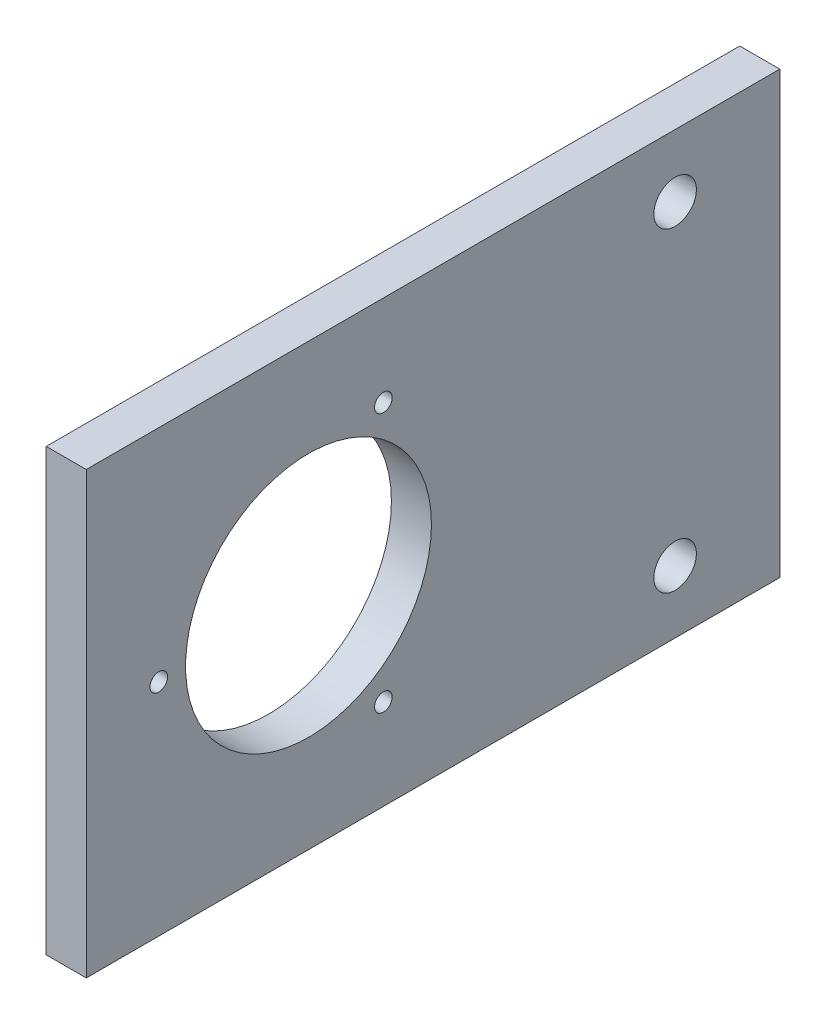
ISO-10303-21;
HEADER;
FILE_DESCRIPTION(('STEP AP214'),'2;1');
FILE_NAME('part.step','',(''),(''),'','','');
FILE_SCHEMA(('AUTOMOTIVE_DESIGN { 1 0 10303 214 1 1 1 1 }'));
ENDSEC;
DATA;
#1=APPLICATION_CONTEXT('core data for automotive mechanical design processes');
#2=APPLICATION_PROTOCOL_DEFINITION('international standard','automotive_design',2000,#1);
#3=PRODUCT_CONTEXT('',#1,'mechanical');
#4=PRODUCT('Part','Part','',(#3));
#5=PRODUCT_RELATED_PRODUCT_CATEGORY('part','',(#4));
#6=PRODUCT_DEFINITION_FORMATION('','',#4);
#7=PRODUCT_DEFINITION_CONTEXT('part definition',#1,'design');
#8=PRODUCT_DEFINITION('design','',#6,#7);
#9=PRODUCT_DEFINITION_SHAPE('','',#8);
#10=(LENGTH_UNIT() NAMED_UNIT(*) SI_UNIT(.MILLI.,.METRE.));
#11=(NAMED_UNIT(*) PLANE_ANGLE_UNIT() SI_UNIT($,.RADIAN.));
#12=(NAMED_UNIT(*) SI_UNIT($,.STERADIAN.) SOLID_ANGLE_UNIT());
#13=UNCERTAINTY_MEASURE_WITH_UNIT(LENGTH_MEASURE(1.E-05),#10,'distance_accuracy_value','');
#14=(GEOMETRIC_REPRESENTATION_CONTEXT(3) GLOBAL_UNCERTAINTY_ASSIGNED_CONTEXT((#13)) GLOBAL_UNIT_ASSIGNED_CONTEXT((#10,
#11,#12)) REPRESENTATION_CONTEXT('',''));
#15=CARTESIAN_POINT('',(0.,0.,0.));
#16=DIRECTION('',(0.,0.,1.));
#17=DIRECTION('',(1.,0.,0.));
#18=AXIS2_PLACEMENT_3D('',#15,#16,#17);
#19=CARTESIAN_POINT('',(6.35,0.,0.));
#20=DIRECTION('',(-1.,0.,0.));
#21=DIRECTION('',(0.,0.,1.));
#22=AXIS2_PLACEMENT_3D('',#19,#20,#21);
#23=PLANE('',#22);
#24=DIRECTION('',(0.,0.,1.));
#25=VECTOR('',#24,1.);
#26=CARTESIAN_POINT('',(6.35,34.925,-55.));
#27=LINE('',#26,#25);
#28=CARTESIAN_POINT('',(6.35,34.925,-55.));
#29=VERTEX_POINT('',#28);
#30=CARTESIAN_POINT('',(6.35,34.925,55.));
#31=VERTEX_POINT('',#30);
#32=EDGE_CURVE('E95',#29,#31,#27,.T.);
#33=ORIENTED_EDGE('',*,*,#32,.T.);
#34=DIRECTION('',(0.,-1.,0.));
#35=VECTOR('',#34,1.);
#36=CARTESIAN_POINT('',(6.35,-34.925,55.));
#37=LINE('',#36,#35);
#38=CARTESIAN_POINT('',(6.35,-34.925,55.));
#39=VERTEX_POINT('',#38);
#40=EDGE_CURVE('E90',#31,#39,#37,.T.);
#41=ORIENTED_EDGE('',*,*,#40,.T.);
#42=DIRECTION('',(0.,0.,-1.));
#43=VECTOR('',#42,1.);
#44=CARTESIAN_POINT('',(6.35,-34.925,-55.));
#45=LINE('',#44,#43);
#46=CARTESIAN_POINT('',(6.35,-34.925,-55.));
#47=VERTEX_POINT('',#46);
#48=EDGE_CURVE('E93',#39,#47,#45,.T.);
#49=ORIENTED_EDGE('',*,*,#48,.T.);
#50=DIRECTION('',(0.,1.,0.));
#51=VECTOR('',#50,1.);
#52=CARTESIAN_POINT('',(6.35,-34.925,-55.));
#53=LINE('',#52,#51);
#54=EDGE_CURVE('E60',#47,#29,#53,.T.);
#55=ORIENTED_EDGE('',*,*,#54,.T.);
#56=EDGE_LOOP('',(#33,#41,#49,#55));
#57=FACE_BOUND('',#56,.T.);
#58=CARTESIAN_POINT('',(6.35,0.,43.5));
#59=DIRECTION('',(1.,0.,0.));
#60=DIRECTION('',(0.,0.,-1.));
#61=AXIS2_PLACEMENT_3D('',#58,#59,#60);
#62=CIRCLE('',#61,1.4);
#63=CARTESIAN_POINT('',(6.35,0.,42.1));
#64=VERTEX_POINT('',#63);
#65=EDGE_CURVE('E110',#64,#64,#62,.T.);
#66=ORIENTED_EDGE('',*,*,#65,.F.);
#67=EDGE_LOOP('',(#66));
#68=FACE_BOUND('',#67,.T.);
#69=CARTESIAN_POINT('',(6.35,-20.5681033398804,7.87499999999994));
#70=DIRECTION('',(1.,0.,0.));
#71=DIRECTION('',(0.,0.,-1.));
#72=AXIS2_PLACEMENT_3D('',#69,#70,#71);
#73=CIRCLE('',#72,1.40000000000002);
#74=CARTESIAN_POINT('',(6.35,-20.5681033398804,6.47499999999992));
#75=VERTEX_POINT('',#74);
#76=EDGE_CURVE('E125',#75,#75,#73,.T.);
#77=ORIENTED_EDGE('',*,*,#76,.F.);
#78=EDGE_LOOP('',(#77));
#79=FACE_BOUND('',#78,.T.);
#80=CARTESIAN_POINT('',(6.35,20.5681033398805,7.87500000000005));
#81=DIRECTION('',(1.,0.,0.));
#82=DIRECTION('',(0.,0.,-1.));
#83=AXIS2_PLACEMENT_3D('',#80,#81,#82);
#84=CIRCLE('',#83,1.39999999999999);
#85=CARTESIAN_POINT('',(6.35,20.5681033398805,6.47500000000006));
#86=VERTEX_POINT('',#85);
#87=EDGE_CURVE('E131',#86,#86,#84,.T.);
#88=ORIENTED_EDGE('',*,*,#87,.F.);
#89=EDGE_LOOP('',(#88));
#90=FACE_BOUND('',#89,.T.);
#91=CARTESIAN_POINT('',(6.35,0.,19.75));
#92=DIRECTION('',(1.,0.,0.));
#93=DIRECTION('',(0.,0.,-1.));
#94=AXIS2_PLACEMENT_3D('',#91,#92,#93);
#95=CIRCLE('',#94,19.5);
#96=CARTESIAN_POINT('',(6.35,0.,0.249999999999997));
#97=VERTEX_POINT('',#96);
#98=EDGE_CURVE('E137',#97,#97,#95,.T.);
#99=ORIENTED_EDGE('',*,*,#98,.F.);
#100=EDGE_LOOP('',(#99));
#101=FACE_BOUND('',#100,.T.);
#102=CARTESIAN_POINT('',(6.35,-25.,-38.4));
#103=DIRECTION('',(1.,0.,0.));
#104=DIRECTION('',(0.,0.,-1.));
#105=AXIS2_PLACEMENT_3D('',#102,#103,#104);
#106=CIRCLE('',#105,3.37312);
#107=CARTESIAN_POINT('',(6.35,-25.,-41.77312));
#108=VERTEX_POINT('',#107);
#109=EDGE_CURVE('E143',#108,#108,#106,.T.);
#110=ORIENTED_EDGE('',*,*,#109,.F.);
#111=EDGE_LOOP('',(#110));
#112=FACE_BOUND('',#111,.T.);
#113=CARTESIAN_POINT('',(6.35,25.,-38.4));
#114=DIRECTION('',(1.,0.,0.));
#115=DIRECTION('',(0.,0.,-1.));
#116=AXIS2_PLACEMENT_3D('',#113,#114,#115);
#117=CIRCLE('',#116,3.37312);
#118=CARTESIAN_POINT('',(6.35,25.,-41.77312));
#119=VERTEX_POINT('',#118);
#120=EDGE_CURVE('E149',#119,#119,#117,.T.);
#121=ORIENTED_EDGE('',*,*,#120,.F.);
#122=EDGE_LOOP('',(#121));
#123=FACE_BOUND('',#122,.T.);
#124=ADVANCED_FACE('F43',(#57,#68,#79,#90,#101,#112,#123),#23,.F.);
#125=CARTESIAN_POINT('',(0.,0.,0.));
#126=DIRECTION('',(-1.,0.,0.));
#127=DIRECTION('',(0.,0.,1.));
#128=AXIS2_PLACEMENT_3D('',#125,#126,#127);
#129=PLANE('',#128);
#130=CARTESIAN_POINT('',(0.,-25.,-38.4));
#131=DIRECTION('',(1.,0.,0.));
#132=DIRECTION('',(0.,0.,-1.));
#133=AXIS2_PLACEMENT_3D('',#130,#131,#132);
#134=CIRCLE('',#133,3.37312);
#135=CARTESIAN_POINT('',(0.,-25.,-41.77312));
#136=VERTEX_POINT('',#135);
#137=EDGE_CURVE('E146',#136,#136,#134,.T.);
#138=ORIENTED_EDGE('',*,*,#137,.T.);
#139=EDGE_LOOP('',(#138));
#140=FACE_BOUND('',#139,.T.);
#141=CARTESIAN_POINT('',(0.,20.5681033398805,7.87500000000005));
#142=DIRECTION('',(1.,0.,0.));
#143=DIRECTION('',(0.,0.,-1.));
#144=AXIS2_PLACEMENT_3D('',#141,#142,#143);
#145=CIRCLE('',#144,1.39999999999999);
#146=CARTESIAN_POINT('',(0.,20.5681033398805,6.47500000000006));
#147=VERTEX_POINT('',#146);
#148=EDGE_CURVE('E134',#147,#147,#145,.T.);
#149=ORIENTED_EDGE('',*,*,#148,.T.);
#150=EDGE_LOOP('',(#149));
#151=FACE_BOUND('',#150,.T.);
#152=CARTESIAN_POINT('',(0.,0.,43.5));
#153=DIRECTION('',(1.,0.,0.));
#154=DIRECTION('',(0.,0.,-1.));
#155=AXIS2_PLACEMENT_3D('',#152,#153,#154);
#156=CIRCLE('',#155,1.4);
#157=CARTESIAN_POINT('',(0.,0.,42.1));
#158=VERTEX_POINT('',#157);
#159=EDGE_CURVE('E122',#158,#158,#156,.T.);
#160=ORIENTED_EDGE('',*,*,#159,.T.);
#161=EDGE_LOOP('',(#160));
#162=FACE_BOUND('',#161,.T.);
#163=DIRECTION('',(0.,0.,1.));
#164=VECTOR('',#163,1.);
#165=CARTESIAN_POINT('',(0.,34.925,-55.));
#166=LINE('',#165,#164);
#167=CARTESIAN_POINT('',(0.,34.925,-55.));
#168=VERTEX_POINT('',#167);
#169=CARTESIAN_POINT('',(0.,34.925,55.));
#170=VERTEX_POINT('',#169);
#171=EDGE_CURVE('E107',#168,#170,#166,.T.);
#172=ORIENTED_EDGE('',*,*,#171,.F.);
#173=DIRECTION('',(0.,1.,0.));
#174=VECTOR('',#173,1.);
#175=CARTESIAN_POINT('',(0.,-34.925,-55.));
#176=LINE('',#175,#174);
#177=CARTESIAN_POINT('',(0.,-34.925,-55.));
#178=VERTEX_POINT('',#177);
#179=EDGE_CURVE('E83',#178,#168,#176,.T.);
#180=ORIENTED_EDGE('',*,*,#179,.F.);
#181=DIRECTION('',(0.,0.,-1.));
#182=VECTOR('',#181,1.);
#183=CARTESIAN_POINT('',(0.,-34.925,-55.));
#184=LINE('',#183,#182);
#185=CARTESIAN_POINT('',(0.,-34.925,55.));
#186=VERTEX_POINT('',#185);
#187=EDGE_CURVE('E77',#186,#178,#184,.T.);
#188=ORIENTED_EDGE('',*,*,#187,.F.);
#189=DIRECTION('',(0.,-1.,0.));
#190=VECTOR('',#189,1.);
#191=CARTESIAN_POINT('',(0.,-34.925,55.));
#192=LINE('',#191,#190);
#193=EDGE_CURVE('E99',#170,#186,#192,.T.);
#194=ORIENTED_EDGE('',*,*,#193,.F.);
#195=EDGE_LOOP('',(#172,#180,#188,#194));
#196=FACE_BOUND('',#195,.T.);
#197=CARTESIAN_POINT('',(0.,-20.5681033398804,7.87499999999994));
#198=DIRECTION('',(1.,0.,0.));
#199=DIRECTION('',(0.,0.,-1.));
#200=AXIS2_PLACEMENT_3D('',#197,#198,#199);
#201=CIRCLE('',#200,1.40000000000002);
#202=CARTESIAN_POINT('',(0.,-20.5681033398804,6.47499999999992));
#203=VERTEX_POINT('',#202);
#204=EDGE_CURVE('E128',#203,#203,#201,.T.);
#205=ORIENTED_EDGE('',*,*,#204,.T.);
#206=EDGE_LOOP('',(#205));
#207=FACE_BOUND('',#206,.T.);
#208=CARTESIAN_POINT('',(0.,0.,19.75));
#209=DIRECTION('',(1.,0.,0.));
#210=DIRECTION('',(0.,0.,-1.));
#211=AXIS2_PLACEMENT_3D('',#208,#209,#210);
#212=CIRCLE('',#211,19.5);
#213=CARTESIAN_POINT('',(0.,0.,0.249999999999997));
#214=VERTEX_POINT('',#213);
#215=EDGE_CURVE('E140',#214,#214,#212,.T.);
#216=ORIENTED_EDGE('',*,*,#215,.T.);
#217=EDGE_LOOP('',(#216));
#218=FACE_BOUND('',#217,.T.);
#219=CARTESIAN_POINT('',(0.,25.,-38.4));
#220=DIRECTION('',(1.,0.,0.));
#221=DIRECTION('',(0.,0.,-1.));
#222=AXIS2_PLACEMENT_3D('',#219,#220,#221);
#223=CIRCLE('',#222,3.37312);
#224=CARTESIAN_POINT('',(0.,25.,-41.77312));
#225=VERTEX_POINT('',#224);
#226=EDGE_CURVE('E152',#225,#225,#223,.T.);
#227=ORIENTED_EDGE('',*,*,#226,.T.);
#228=EDGE_LOOP('',(#227));
#229=FACE_BOUND('',#228,.T.);
#230=ADVANCED_FACE('F118',(#140,#151,#162,#196,#207,#218,#229),#129,.T.);
#231=CARTESIAN_POINT('',(6.35,34.925,-55.));
#232=DIRECTION('',(0.,-1.,0.));
#233=DIRECTION('',(0.,0.,-1.));
#234=AXIS2_PLACEMENT_3D('',#231,#232,#233);
#235=PLANE('',#234);
#236=ORIENTED_EDGE('',*,*,#171,.T.);
#237=DIRECTION('',(-1.,0.,0.));
#238=VECTOR('',#237,1.);
#239=CARTESIAN_POINT('',(6.35,34.925,55.));
#240=LINE('',#239,#238);
#241=EDGE_CURVE('E11',#31,#170,#240,.T.);
#242=ORIENTED_EDGE('',*,*,#241,.F.);
#243=ORIENTED_EDGE('',*,*,#32,.F.);
#244=DIRECTION('',(-1.,0.,0.));
#245=VECTOR('',#244,1.);
#246=CARTESIAN_POINT('',(6.35,34.925,-55.));
#247=LINE('',#246,#245);
#248=EDGE_CURVE('E103',#29,#168,#247,.T.);
#249=ORIENTED_EDGE('',*,*,#248,.T.);
#250=EDGE_LOOP('',(#236,#242,#243,#249));
#251=FACE_BOUND('',#250,.T.);
#252=ADVANCED_FACE('F45',(#251),#235,.F.);
#253=CARTESIAN_POINT('',(6.35,-34.925,55.));
#254=DIRECTION('',(0.,0.,-1.));
#255=DIRECTION('',(-1.,0.,0.));
#256=AXIS2_PLACEMENT_3D('',#253,#254,#255);
#257=PLANE('',#256);
#258=ORIENTED_EDGE('',*,*,#193,.T.);
#259=DIRECTION('',(-1.,0.,0.));
#260=VECTOR('',#259,1.);
#261=CARTESIAN_POINT('',(6.35,-34.925,55.));
#262=LINE('',#261,#260);
#263=EDGE_CURVE('E52',#39,#186,#262,.T.);
#264=ORIENTED_EDGE('',*,*,#263,.F.);
#265=ORIENTED_EDGE('',*,*,#40,.F.);
#266=ORIENTED_EDGE('',*,*,#241,.T.);
#267=EDGE_LOOP('',(#258,#264,#265,#266));
#268=FACE_BOUND('',#267,.T.);
#269=ADVANCED_FACE('F98',(#268),#257,.F.);
#270=CARTESIAN_POINT('',(6.35,-34.925,-55.));
#271=DIRECTION('',(0.,1.,0.));
#272=DIRECTION('',(0.,0.,1.));
#273=AXIS2_PLACEMENT_3D('',#270,#271,#272);
#274=PLANE('',#273);
#275=ORIENTED_EDGE('',*,*,#187,.T.);
#276=DIRECTION('',(-1.,0.,0.));
#277=VECTOR('',#276,1.);
#278=CARTESIAN_POINT('',(6.35,-34.925,-55.));
#279=LINE('',#278,#277);
#280=EDGE_CURVE('E100',#47,#178,#279,.T.);
#281=ORIENTED_EDGE('',*,*,#280,.F.);
#282=ORIENTED_EDGE('',*,*,#48,.F.);
#283=ORIENTED_EDGE('',*,*,#263,.T.);
#284=EDGE_LOOP('',(#275,#281,#282,#283));
#285=FACE_BOUND('',#284,.T.);
#286=ADVANCED_FACE('F101',(#285),#274,.F.);
#287=CARTESIAN_POINT('',(6.35,-34.925,-55.));
#288=DIRECTION('',(0.,0.,1.));
#289=DIRECTION('',(1.,0.,0.));
#290=AXIS2_PLACEMENT_3D('',#287,#288,#289);
#291=PLANE('',#290);
#292=ORIENTED_EDGE('',*,*,#179,.T.);
#293=ORIENTED_EDGE('',*,*,#248,.F.);
#294=ORIENTED_EDGE('',*,*,#54,.F.);
#295=ORIENTED_EDGE('',*,*,#280,.T.);
#296=EDGE_LOOP('',(#292,#293,#294,#295));
#297=FACE_BOUND('',#296,.T.);
#298=ADVANCED_FACE('F115',(#297),#291,.F.);
#299=CARTESIAN_POINT('',(6.35,0.,43.5));
#300=DIRECTION('',(-1.,0.,0.));
#301=DIRECTION('',(0.,0.,1.));
#302=AXIS2_PLACEMENT_3D('',#299,#300,#301);
#303=CYLINDRICAL_SURFACE('',#302,1.4);
#304=ORIENTED_EDGE('',*,*,#65,.T.);
#305=EDGE_LOOP('',(#304));
#306=FACE_BOUND('',#305,.T.);
#307=ORIENTED_EDGE('',*,*,#159,.F.);
#308=EDGE_LOOP('',(#307));
#309=FACE_BOUND('',#308,.T.);
#310=ADVANCED_FACE('F169',(#306,#309),#303,.F.);
#311=CARTESIAN_POINT('',(6.35,-20.5681033398804,7.87499999999994));
#312=DIRECTION('',(-1.,0.,0.));
#313=DIRECTION('',(0.,0.,1.));
#314=AXIS2_PLACEMENT_3D('',#311,#312,#313);
#315=CYLINDRICAL_SURFACE('',#314,1.40000000000002);
#316=ORIENTED_EDGE('',*,*,#76,.T.);
#317=EDGE_LOOP('',(#316));
#318=FACE_BOUND('',#317,.T.);
#319=ORIENTED_EDGE('',*,*,#204,.F.);
#320=EDGE_LOOP('',(#319));
#321=FACE_BOUND('',#320,.T.);
#322=ADVANCED_FACE('F214',(#318,#321),#315,.F.);
#323=CARTESIAN_POINT('',(6.35,20.5681033398805,7.87500000000005));
#324=DIRECTION('',(-1.,0.,0.));
#325=DIRECTION('',(0.,0.,1.));
#326=AXIS2_PLACEMENT_3D('',#323,#324,#325);
#327=CYLINDRICAL_SURFACE('',#326,1.39999999999999);
#328=ORIENTED_EDGE('',*,*,#87,.T.);
#329=EDGE_LOOP('',(#328));
#330=FACE_BOUND('',#329,.T.);
#331=ORIENTED_EDGE('',*,*,#148,.F.);
#332=EDGE_LOOP('',(#331));
#333=FACE_BOUND('',#332,.T.);
#334=ADVANCED_FACE('F222',(#330,#333),#327,.F.);
#335=CARTESIAN_POINT('',(6.35,0.,19.75));
#336=DIRECTION('',(-1.,0.,0.));
#337=DIRECTION('',(0.,0.,1.));
#338=AXIS2_PLACEMENT_3D('',#335,#336,#337);
#339=CYLINDRICAL_SURFACE('',#338,19.5);
#340=ORIENTED_EDGE('',*,*,#98,.T.);
#341=EDGE_LOOP('',(#340));
#342=FACE_BOUND('',#341,.T.);
#343=ORIENTED_EDGE('',*,*,#215,.F.);
#344=EDGE_LOOP('',(#343));
#345=FACE_BOUND('',#344,.T.);
#346=ADVANCED_FACE('F230',(#342,#345),#339,.F.);
#347=CARTESIAN_POINT('',(6.35,-25.,-38.4));
#348=DIRECTION('',(-1.,0.,0.));
#349=DIRECTION('',(0.,0.,1.));
#350=AXIS2_PLACEMENT_3D('',#347,#348,#349);
#351=CYLINDRICAL_SURFACE('',#350,3.37312);
#352=ORIENTED_EDGE('',*,*,#109,.T.);
#353=EDGE_LOOP('',(#352));
#354=FACE_BOUND('',#353,.T.);
#355=ORIENTED_EDGE('',*,*,#137,.F.);
#356=EDGE_LOOP('',(#355));
#357=FACE_BOUND('',#356,.T.);
#358=ADVANCED_FACE('F239',(#354,#357),#351,.F.);
#359=CARTESIAN_POINT('',(6.35,25.,-38.4));
#360=DIRECTION('',(-1.,0.,0.));
#361=DIRECTION('',(0.,0.,1.));
#362=AXIS2_PLACEMENT_3D('',#359,#360,#361);
#363=CYLINDRICAL_SURFACE('',#362,3.37312);
#364=ORIENTED_EDGE('',*,*,#120,.T.);
#365=EDGE_LOOP('',(#364));
#366=FACE_BOUND('',#365,.T.);
#367=ORIENTED_EDGE('',*,*,#226,.F.);
#368=EDGE_LOOP('',(#367));
#369=FACE_BOUND('',#368,.T.);
#370=ADVANCED_FACE('F158',(#366,#369),#363,.F.);
#371=CLOSED_SHELL('',(#124,#230,#252,#269,#286,#298,#310,#322,#334,#346,#358,#370));
#372=MANIFOLD_SOLID_BREP('B2',#371);
#373=ADVANCED_BREP_SHAPE_REPRESENTATION('',(#18,#372),#14);
#374=SHAPE_DEFINITION_REPRESENTATION(#9,#373);
ENDSEC;
END-ISO-10303-21;
